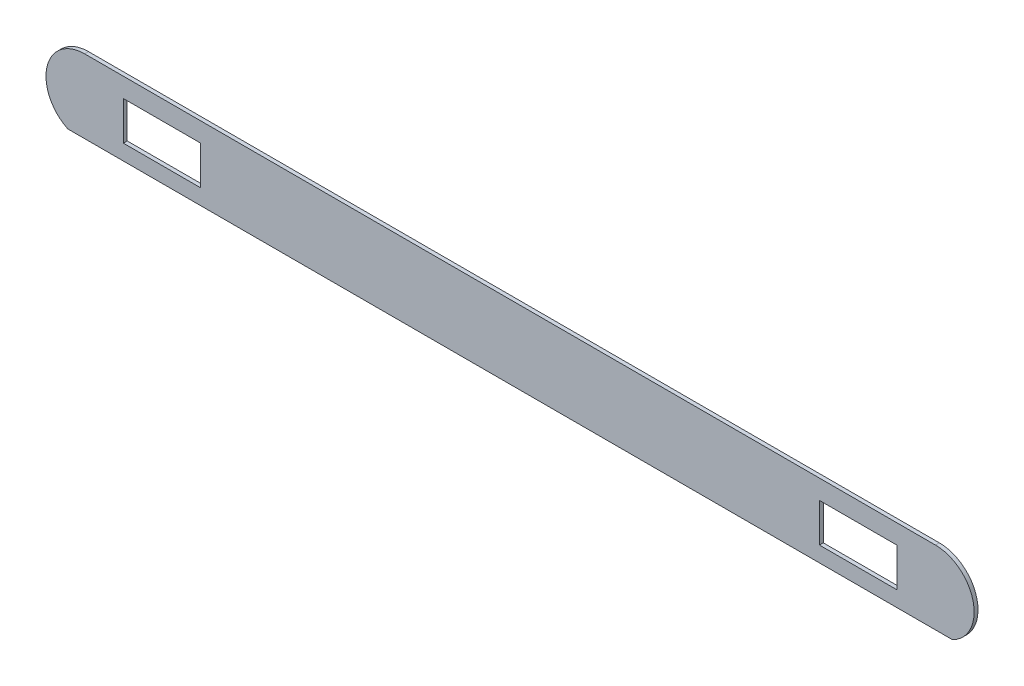
ISO-10303-21;
HEADER;
FILE_DESCRIPTION(('STEP AP214'),'2;1');
FILE_NAME('part.step','',(''),(''),'','','');
FILE_SCHEMA(('AUTOMOTIVE_DESIGN { 1 0 10303 214 1 1 1 1 }'));
ENDSEC;
DATA;
#1=APPLICATION_CONTEXT('core data for automotive mechanical design processes');
#2=APPLICATION_PROTOCOL_DEFINITION('international standard','automotive_design',2000,#1);
#3=PRODUCT_CONTEXT('',#1,'mechanical');
#4=PRODUCT('Part','Part','',(#3));
#5=PRODUCT_RELATED_PRODUCT_CATEGORY('part','',(#4));
#6=PRODUCT_DEFINITION_FORMATION('','',#4);
#7=PRODUCT_DEFINITION_CONTEXT('part definition',#1,'design');
#8=PRODUCT_DEFINITION('design','',#6,#7);
#9=PRODUCT_DEFINITION_SHAPE('','',#8);
#10=(LENGTH_UNIT() NAMED_UNIT(*) SI_UNIT(.MILLI.,.METRE.));
#11=(NAMED_UNIT(*) PLANE_ANGLE_UNIT() SI_UNIT($,.RADIAN.));
#12=(NAMED_UNIT(*) SI_UNIT($,.STERADIAN.) SOLID_ANGLE_UNIT());
#13=UNCERTAINTY_MEASURE_WITH_UNIT(LENGTH_MEASURE(1.E-05),#10,'distance_accuracy_value','');
#14=(GEOMETRIC_REPRESENTATION_CONTEXT(3) GLOBAL_UNCERTAINTY_ASSIGNED_CONTEXT((#13)) GLOBAL_UNIT_ASSIGNED_CONTEXT((#10,
#11,#12)) REPRESENTATION_CONTEXT('',''));
#15=CARTESIAN_POINT('',(0.,0.,0.));
#16=DIRECTION('',(0.,0.,1.));
#17=DIRECTION('',(1.,0.,0.));
#18=AXIS2_PLACEMENT_3D('',#15,#16,#17);
#19=CARTESIAN_POINT('',(0.,-45.,0.));
#20=DIRECTION('',(0.,1.,0.));
#21=DIRECTION('',(0.,0.,1.));
#22=AXIS2_PLACEMENT_3D('',#19,#20,#21);
#23=PLANE('',#22);
#24=DIRECTION('',(0.,0.,-1.));
#25=VECTOR('',#24,1.);
#26=CARTESIAN_POINT('',(619.060752759772,-45.,80.));
#27=LINE('',#26,#25);
#28=CARTESIAN_POINT('',(619.060752759772,-45.,5.));
#29=VERTEX_POINT('',#28);
#30=CARTESIAN_POINT('',(619.060752759772,-45.,0.));
#31=VERTEX_POINT('',#30);
#32=EDGE_CURVE('E217',#29,#31,#27,.T.);
#33=ORIENTED_EDGE('',*,*,#32,.F.);
#34=DIRECTION('',(-1.,0.,0.));
#35=VECTOR('',#34,1.);
#36=CARTESIAN_POINT('',(597.266258042068,-45.,5.));
#37=LINE('',#36,#35);
#38=CARTESIAN_POINT('',(-524.528236675635,-45.,5.));
#39=VERTEX_POINT('',#38);
#40=EDGE_CURVE('E11',#29,#39,#37,.T.);
#41=ORIENTED_EDGE('',*,*,#40,.T.);
#42=DIRECTION('',(0.,0.,-1.));
#43=VECTOR('',#42,1.);
#44=CARTESIAN_POINT('',(-524.528236675635,-45.,80.));
#45=LINE('',#44,#43);
#46=CARTESIAN_POINT('',(-524.528236675635,-45.,0.));
#47=VERTEX_POINT('',#46);
#48=EDGE_CURVE('E55',#47,#39,#45,.F.);
#49=ORIENTED_EDGE('',*,*,#48,.F.);
#50=DIRECTION('',(-1.,0.,0.));
#51=VECTOR('',#50,1.);
#52=CARTESIAN_POINT('',(-502.733741957931,-45.,0.));
#53=LINE('',#52,#51);
#54=EDGE_CURVE('E37',#31,#47,#53,.T.);
#55=ORIENTED_EDGE('',*,*,#54,.F.);
#56=EDGE_LOOP('',(#33,#41,#49,#55));
#57=FACE_BOUND('',#56,.T.);
#58=ADVANCED_FACE('F34',(#57),#23,.F.);
#59=CARTESIAN_POINT('',(-502.733741957931,0.,0.));
#60=DIRECTION('',(0.,0.,1.));
#61=DIRECTION('',(1.,0.,0.));
#62=AXIS2_PLACEMENT_3D('',#59,#60,#61);
#63=PLANE('',#62);
#64=DIRECTION('',(-1.,0.,0.));
#65=VECTOR('',#64,1.);
#66=CARTESIAN_POINT('',(-502.733741957931,25.,0.));
#67=LINE('',#66,#65);
#68=CARTESIAN_POINT('',(-352.733741957931,25.,0.));
#69=VERTEX_POINT('',#68);
#70=CARTESIAN_POINT('',(-452.733741957932,25.,0.));
#71=VERTEX_POINT('',#70);
#72=EDGE_CURVE('E192',#69,#71,#67,.T.);
#73=ORIENTED_EDGE('',*,*,#72,.T.);
#74=DIRECTION('',(0.,-1.,0.));
#75=VECTOR('',#74,1.);
#76=CARTESIAN_POINT('',(-452.733741957932,0.,0.));
#77=LINE('',#76,#75);
#78=CARTESIAN_POINT('',(-452.733741957932,-25.,0.));
#79=VERTEX_POINT('',#78);
#80=EDGE_CURVE('E195',#71,#79,#77,.T.);
#81=ORIENTED_EDGE('',*,*,#80,.T.);
#82=DIRECTION('',(1.,0.,0.));
#83=VECTOR('',#82,1.);
#84=CARTESIAN_POINT('',(-502.733741957931,-25.,0.));
#85=LINE('',#84,#83);
#86=CARTESIAN_POINT('',(-352.733741957931,-25.,0.));
#87=VERTEX_POINT('',#86);
#88=EDGE_CURVE('E189',#79,#87,#85,.T.);
#89=ORIENTED_EDGE('',*,*,#88,.T.);
#90=DIRECTION('',(0.,1.,0.));
#91=VECTOR('',#90,1.);
#92=CARTESIAN_POINT('',(-352.733741957931,0.,0.));
#93=LINE('',#92,#91);
#94=EDGE_CURVE('E130',#87,#69,#93,.T.);
#95=ORIENTED_EDGE('',*,*,#94,.T.);
#96=EDGE_LOOP('',(#73,#81,#89,#95));
#97=FACE_BOUND('',#96,.T.);
#98=DIRECTION('',(-1.,0.,0.));
#99=VECTOR('',#98,1.);
#100=CARTESIAN_POINT('',(-502.733741957931,25.0000000000004,0.));
#101=LINE('',#100,#99);
#102=CARTESIAN_POINT('',(547.266258042068,25.,0.));
#103=VERTEX_POINT('',#102);
#104=CARTESIAN_POINT('',(447.266258042068,25.,0.));
#105=VERTEX_POINT('',#104);
#106=EDGE_CURVE('E183',#103,#105,#101,.T.);
#107=ORIENTED_EDGE('',*,*,#106,.T.);
#108=DIRECTION('',(0.,-1.,0.));
#109=VECTOR('',#108,1.);
#110=CARTESIAN_POINT('',(447.266258042068,0.,0.));
#111=LINE('',#110,#109);
#112=CARTESIAN_POINT('',(447.266258042068,-25.,0.));
#113=VERTEX_POINT('',#112);
#114=EDGE_CURVE('E186',#105,#113,#111,.T.);
#115=ORIENTED_EDGE('',*,*,#114,.T.);
#116=DIRECTION('',(1.,0.,0.));
#117=VECTOR('',#116,1.);
#118=CARTESIAN_POINT('',(-502.733741957931,-25.,0.));
#119=LINE('',#118,#117);
#120=CARTESIAN_POINT('',(547.266258042068,-25.,0.));
#121=VERTEX_POINT('',#120);
#122=EDGE_CURVE('E155',#113,#121,#119,.T.);
#123=ORIENTED_EDGE('',*,*,#122,.T.);
#124=DIRECTION('',(0.,1.,0.));
#125=VECTOR('',#124,1.);
#126=CARTESIAN_POINT('',(547.266258042068,0.,0.));
#127=LINE('',#126,#125);
#128=EDGE_CURVE('E180',#121,#103,#127,.T.);
#129=ORIENTED_EDGE('',*,*,#128,.T.);
#130=EDGE_LOOP('',(#107,#115,#123,#129));
#131=FACE_BOUND('',#130,.T.);
#132=CARTESIAN_POINT('',(597.266258042068,0.,0.));
#133=DIRECTION('',(0.,0.,1.));
#134=DIRECTION('',(1.,0.,0.));
#135=AXIS2_PLACEMENT_3D('',#132,#133,#134);
#136=CIRCLE('',#135,50.);
#137=CARTESIAN_POINT('',(597.266258042068,50.,0.));
#138=VERTEX_POINT('',#137);
#139=EDGE_CURVE('E210',#31,#138,#136,.T.);
#140=ORIENTED_EDGE('',*,*,#139,.F.);
#141=ORIENTED_EDGE('',*,*,#54,.T.);
#142=CARTESIAN_POINT('',(-502.733741957931,0.,0.));
#143=DIRECTION('',(0.,0.,1.));
#144=DIRECTION('',(1.,0.,0.));
#145=AXIS2_PLACEMENT_3D('',#142,#143,#144);
#146=CIRCLE('',#145,50.);
#147=CARTESIAN_POINT('',(-502.733741957931,50.,0.));
#148=VERTEX_POINT('',#147);
#149=EDGE_CURVE('E214',#148,#47,#146,.T.);
#150=ORIENTED_EDGE('',*,*,#149,.F.);
#151=DIRECTION('',(-1.,0.,0.));
#152=VECTOR('',#151,1.);
#153=CARTESIAN_POINT('',(-502.733741957931,50.,0.));
#154=LINE('',#153,#152);
#155=EDGE_CURVE('E204',#138,#148,#154,.T.);
#156=ORIENTED_EDGE('',*,*,#155,.F.);
#157=EDGE_LOOP('',(#140,#141,#150,#156));
#158=FACE_BOUND('',#157,.T.);
#159=ADVANCED_FACE('F222',(#97,#131,#158),#63,.F.);
#160=CARTESIAN_POINT('',(-502.733741957931,0.,80.));
#161=DIRECTION('',(0.,0.,-1.));
#162=DIRECTION('',(-1.,0.,0.));
#163=AXIS2_PLACEMENT_3D('',#160,#161,#162);
#164=CYLINDRICAL_SURFACE('',#163,50.);
#165=ORIENTED_EDGE('',*,*,#149,.T.);
#166=ORIENTED_EDGE('',*,*,#48,.T.);
#167=CARTESIAN_POINT('',(-502.733741957931,0.,5.));
#168=DIRECTION('',(0.,0.,1.));
#169=DIRECTION('',(1.,0.,0.));
#170=AXIS2_PLACEMENT_3D('',#167,#168,#169);
#171=CIRCLE('',#170,50.);
#172=CARTESIAN_POINT('',(-502.733741957931,50.,5.));
#173=VERTEX_POINT('',#172);
#174=EDGE_CURVE('E216',#173,#39,#171,.T.);
#175=ORIENTED_EDGE('',*,*,#174,.F.);
#176=DIRECTION('',(0.,0.,-1.));
#177=VECTOR('',#176,1.);
#178=CARTESIAN_POINT('',(-502.733741957931,50.,80.));
#179=LINE('',#178,#177);
#180=EDGE_CURVE('E201',#173,#148,#179,.T.);
#181=ORIENTED_EDGE('',*,*,#180,.T.);
#182=EDGE_LOOP('',(#165,#166,#175,#181));
#183=FACE_BOUND('',#182,.T.);
#184=ADVANCED_FACE('F225',(#183),#164,.T.);
#185=CARTESIAN_POINT('',(597.266258042068,0.,80.));
#186=DIRECTION('',(0.,0.,-1.));
#187=DIRECTION('',(-1.,0.,0.));
#188=AXIS2_PLACEMENT_3D('',#185,#186,#187);
#189=CYLINDRICAL_SURFACE('',#188,50.);
#190=CARTESIAN_POINT('',(597.266258042068,0.,5.));
#191=DIRECTION('',(0.,0.,1.));
#192=DIRECTION('',(1.,0.,0.));
#193=AXIS2_PLACEMENT_3D('',#190,#191,#192);
#194=CIRCLE('',#193,50.);
#195=CARTESIAN_POINT('',(597.266258042068,50.,5.));
#196=VERTEX_POINT('',#195);
#197=EDGE_CURVE('E212',#29,#196,#194,.T.);
#198=ORIENTED_EDGE('',*,*,#197,.F.);
#199=ORIENTED_EDGE('',*,*,#32,.T.);
#200=ORIENTED_EDGE('',*,*,#139,.T.);
#201=DIRECTION('',(0.,0.,-1.));
#202=VECTOR('',#201,1.);
#203=CARTESIAN_POINT('',(597.266258042068,50.,80.));
#204=LINE('',#203,#202);
#205=EDGE_CURVE('E198',#196,#138,#204,.T.);
#206=ORIENTED_EDGE('',*,*,#205,.F.);
#207=EDGE_LOOP('',(#198,#199,#200,#206));
#208=FACE_BOUND('',#207,.T.);
#209=ADVANCED_FACE('F233',(#208),#189,.T.);
#210=CARTESIAN_POINT('',(597.266258042068,-45.,5.));
#211=DIRECTION('',(0.,0.,1.));
#212=DIRECTION('',(1.,0.,0.));
#213=AXIS2_PLACEMENT_3D('',#210,#211,#212);
#214=PLANE('',#213);
#215=ORIENTED_EDGE('',*,*,#40,.F.);
#216=ORIENTED_EDGE('',*,*,#197,.T.);
#217=DIRECTION('',(1.,0.,0.));
#218=VECTOR('',#217,1.);
#219=CARTESIAN_POINT('',(-502.733741957931,50.,5.));
#220=LINE('',#219,#218);
#221=EDGE_CURVE('E207',#173,#196,#220,.T.);
#222=ORIENTED_EDGE('',*,*,#221,.F.);
#223=ORIENTED_EDGE('',*,*,#174,.T.);
#224=EDGE_LOOP('',(#215,#216,#222,#223));
#225=FACE_BOUND('',#224,.T.);
#226=DIRECTION('',(0.,-1.,0.));
#227=VECTOR('',#226,1.);
#228=CARTESIAN_POINT('',(-452.733741957932,25.,5.));
#229=LINE('',#228,#227);
#230=CARTESIAN_POINT('',(-452.733741957932,25.,5.));
#231=VERTEX_POINT('',#230);
#232=CARTESIAN_POINT('',(-452.733741957931,-25.,5.));
#233=VERTEX_POINT('',#232);
#234=EDGE_CURVE('E143',#231,#233,#229,.T.);
#235=ORIENTED_EDGE('',*,*,#234,.F.);
#236=DIRECTION('',(-1.,0.,0.));
#237=VECTOR('',#236,1.);
#238=CARTESIAN_POINT('',(-452.733741957932,25.,5.));
#239=LINE('',#238,#237);
#240=CARTESIAN_POINT('',(-352.733741957931,25.,5.));
#241=VERTEX_POINT('',#240);
#242=EDGE_CURVE('E148',#241,#231,#239,.T.);
#243=ORIENTED_EDGE('',*,*,#242,.F.);
#244=DIRECTION('',(0.,1.,0.));
#245=VECTOR('',#244,1.);
#246=CARTESIAN_POINT('',(-352.733741957931,25.,5.));
#247=LINE('',#246,#245);
#248=CARTESIAN_POINT('',(-352.733741957931,-25.,5.));
#249=VERTEX_POINT('',#248);
#250=EDGE_CURVE('E127',#249,#241,#247,.T.);
#251=ORIENTED_EDGE('',*,*,#250,.F.);
#252=DIRECTION('',(1.,0.,0.));
#253=VECTOR('',#252,1.);
#254=CARTESIAN_POINT('',(-452.733741957932,-25.,5.));
#255=LINE('',#254,#253);
#256=EDGE_CURVE('E138',#233,#249,#255,.T.);
#257=ORIENTED_EDGE('',*,*,#256,.F.);
#258=EDGE_LOOP('',(#235,#243,#251,#257));
#259=FACE_BOUND('',#258,.T.);
#260=DIRECTION('',(0.,-1.,0.));
#261=VECTOR('',#260,1.);
#262=CARTESIAN_POINT('',(447.266258042068,25.,5.));
#263=LINE('',#262,#261);
#264=CARTESIAN_POINT('',(447.266258042068,25.,5.));
#265=VERTEX_POINT('',#264);
#266=CARTESIAN_POINT('',(447.266258042068,-25.,5.));
#267=VERTEX_POINT('',#266);
#268=EDGE_CURVE('E158',#265,#267,#263,.T.);
#269=ORIENTED_EDGE('',*,*,#268,.F.);
#270=DIRECTION('',(-1.,0.,0.));
#271=VECTOR('',#270,1.);
#272=CARTESIAN_POINT('',(447.266258042068,25.,5.));
#273=LINE('',#272,#271);
#274=CARTESIAN_POINT('',(547.266258042068,25.,5.));
#275=VERTEX_POINT('',#274);
#276=EDGE_CURVE('E166',#275,#265,#273,.T.);
#277=ORIENTED_EDGE('',*,*,#276,.F.);
#278=DIRECTION('',(0.,1.,0.));
#279=VECTOR('',#278,1.);
#280=CARTESIAN_POINT('',(547.266258042068,25.,5.));
#281=LINE('',#280,#279);
#282=CARTESIAN_POINT('',(547.266258042068,-25.,5.));
#283=VERTEX_POINT('',#282);
#284=EDGE_CURVE('E163',#283,#275,#281,.T.);
#285=ORIENTED_EDGE('',*,*,#284,.F.);
#286=DIRECTION('',(1.,0.,0.));
#287=VECTOR('',#286,1.);
#288=CARTESIAN_POINT('',(447.266258042068,-25.,5.));
#289=LINE('',#288,#287);
#290=EDGE_CURVE('E160',#267,#283,#289,.T.);
#291=ORIENTED_EDGE('',*,*,#290,.F.);
#292=EDGE_LOOP('',(#269,#277,#285,#291));
#293=FACE_BOUND('',#292,.T.);
#294=ADVANCED_FACE('F145',(#225,#259,#293),#214,.T.);
#295=CARTESIAN_POINT('',(-502.733741957931,50.,80.));
#296=DIRECTION('',(0.,-1.,0.));
#297=DIRECTION('',(0.,0.,-1.));
#298=AXIS2_PLACEMENT_3D('',#295,#296,#297);
#299=PLANE('',#298);
#300=ORIENTED_EDGE('',*,*,#180,.F.);
#301=ORIENTED_EDGE('',*,*,#221,.T.);
#302=ORIENTED_EDGE('',*,*,#205,.T.);
#303=ORIENTED_EDGE('',*,*,#155,.T.);
#304=EDGE_LOOP('',(#300,#301,#302,#303));
#305=FACE_BOUND('',#304,.T.);
#306=ADVANCED_FACE('F229',(#305),#299,.F.);
#307=CARTESIAN_POINT('',(447.266258042068,25.,-5.));
#308=DIRECTION('',(-1.,0.,0.));
#309=DIRECTION('',(0.,0.,1.));
#310=AXIS2_PLACEMENT_3D('',#307,#308,#309);
#311=PLANE('',#310);
#312=DIRECTION('',(0.,0.,1.));
#313=VECTOR('',#312,1.);
#314=CARTESIAN_POINT('',(447.266258042068,25.,-5.));
#315=LINE('',#314,#313);
#316=EDGE_CURVE('E170',#105,#265,#315,.T.);
#317=ORIENTED_EDGE('',*,*,#316,.T.);
#318=ORIENTED_EDGE('',*,*,#268,.T.);
#319=DIRECTION('',(0.,0.,1.));
#320=VECTOR('',#319,1.);
#321=CARTESIAN_POINT('',(447.266258042068,-25.,-5.));
#322=LINE('',#321,#320);
#323=EDGE_CURVE('E169',#113,#267,#322,.T.);
#324=ORIENTED_EDGE('',*,*,#323,.F.);
#325=ORIENTED_EDGE('',*,*,#114,.F.);
#326=EDGE_LOOP('',(#317,#318,#324,#325));
#327=FACE_BOUND('',#326,.T.);
#328=ADVANCED_FACE('F239',(#327),#311,.F.);
#329=CARTESIAN_POINT('',(447.266258042068,25.,-5.));
#330=DIRECTION('',(0.,1.,0.));
#331=DIRECTION('',(-1.,0.,0.));
#332=AXIS2_PLACEMENT_3D('',#329,#330,#331);
#333=PLANE('',#332);
#334=DIRECTION('',(0.,0.,1.));
#335=VECTOR('',#334,1.);
#336=CARTESIAN_POINT('',(547.266258042068,25.,-5.));
#337=LINE('',#336,#335);
#338=EDGE_CURVE('E172',#103,#275,#337,.T.);
#339=ORIENTED_EDGE('',*,*,#338,.T.);
#340=ORIENTED_EDGE('',*,*,#276,.T.);
#341=ORIENTED_EDGE('',*,*,#316,.F.);
#342=ORIENTED_EDGE('',*,*,#106,.F.);
#343=EDGE_LOOP('',(#339,#340,#341,#342));
#344=FACE_BOUND('',#343,.T.);
#345=ADVANCED_FACE('F264',(#344),#333,.F.);
#346=CARTESIAN_POINT('',(547.266258042068,25.,-5.));
#347=DIRECTION('',(1.,0.,0.));
#348=DIRECTION('',(0.,0.,-1.));
#349=AXIS2_PLACEMENT_3D('',#346,#347,#348);
#350=PLANE('',#349);
#351=DIRECTION('',(0.,0.,1.));
#352=VECTOR('',#351,1.);
#353=CARTESIAN_POINT('',(547.266258042068,-25.,-5.));
#354=LINE('',#353,#352);
#355=EDGE_CURVE('E174',#121,#283,#354,.T.);
#356=ORIENTED_EDGE('',*,*,#355,.T.);
#357=ORIENTED_EDGE('',*,*,#284,.T.);
#358=ORIENTED_EDGE('',*,*,#338,.F.);
#359=ORIENTED_EDGE('',*,*,#128,.F.);
#360=EDGE_LOOP('',(#356,#357,#358,#359));
#361=FACE_BOUND('',#360,.T.);
#362=ADVANCED_FACE('F267',(#361),#350,.F.);
#363=CARTESIAN_POINT('',(447.266258042068,-25.,-5.));
#364=DIRECTION('',(0.,-1.,0.));
#365=DIRECTION('',(0.,0.,-1.));
#366=AXIS2_PLACEMENT_3D('',#363,#364,#365);
#367=PLANE('',#366);
#368=ORIENTED_EDGE('',*,*,#323,.T.);
#369=ORIENTED_EDGE('',*,*,#290,.T.);
#370=ORIENTED_EDGE('',*,*,#355,.F.);
#371=ORIENTED_EDGE('',*,*,#122,.F.);
#372=EDGE_LOOP('',(#368,#369,#370,#371));
#373=FACE_BOUND('',#372,.T.);
#374=ADVANCED_FACE('F262',(#373),#367,.F.);
#375=CARTESIAN_POINT('',(-452.733741957932,25.,-5.));
#376=DIRECTION('',(-1.,0.,0.));
#377=DIRECTION('',(0.,0.,1.));
#378=AXIS2_PLACEMENT_3D('',#375,#376,#377);
#379=PLANE('',#378);
#380=DIRECTION('',(0.,0.,1.));
#381=VECTOR('',#380,1.);
#382=CARTESIAN_POINT('',(-452.733741957932,25.,-5.));
#383=LINE('',#382,#381);
#384=EDGE_CURVE('E153',#71,#231,#383,.T.);
#385=ORIENTED_EDGE('',*,*,#384,.T.);
#386=ORIENTED_EDGE('',*,*,#234,.T.);
#387=DIRECTION('',(0.,0.,1.));
#388=VECTOR('',#387,1.);
#389=CARTESIAN_POINT('',(-452.733741957932,-25.,-5.));
#390=LINE('',#389,#388);
#391=EDGE_CURVE('E134',#79,#233,#390,.T.);
#392=ORIENTED_EDGE('',*,*,#391,.F.);
#393=ORIENTED_EDGE('',*,*,#80,.F.);
#394=EDGE_LOOP('',(#385,#386,#392,#393));
#395=FACE_BOUND('',#394,.T.);
#396=ADVANCED_FACE('F259',(#395),#379,.F.);
#397=CARTESIAN_POINT('',(-452.733741957932,25.,-5.));
#398=DIRECTION('',(0.,1.,0.));
#399=DIRECTION('',(0.,0.,1.));
#400=AXIS2_PLACEMENT_3D('',#397,#398,#399);
#401=PLANE('',#400);
#402=DIRECTION('',(0.,0.,1.));
#403=VECTOR('',#402,1.);
#404=CARTESIAN_POINT('',(-352.733741957931,25.,-5.));
#405=LINE('',#404,#403);
#406=EDGE_CURVE('E133',#69,#241,#405,.T.);
#407=ORIENTED_EDGE('',*,*,#406,.T.);
#408=ORIENTED_EDGE('',*,*,#242,.T.);
#409=ORIENTED_EDGE('',*,*,#384,.F.);
#410=ORIENTED_EDGE('',*,*,#72,.F.);
#411=EDGE_LOOP('',(#407,#408,#409,#410));
#412=FACE_BOUND('',#411,.T.);
#413=ADVANCED_FACE('F255',(#412),#401,.F.);
#414=CARTESIAN_POINT('',(-352.733741957931,25.,-5.));
#415=DIRECTION('',(1.,0.,0.));
#416=DIRECTION('',(0.,0.,-1.));
#417=AXIS2_PLACEMENT_3D('',#414,#415,#416);
#418=PLANE('',#417);
#419=DIRECTION('',(0.,0.,1.));
#420=VECTOR('',#419,1.);
#421=CARTESIAN_POINT('',(-352.733741957931,-25.,-5.));
#422=LINE('',#421,#420);
#423=EDGE_CURVE('E122',#87,#249,#422,.T.);
#424=ORIENTED_EDGE('',*,*,#423,.T.);
#425=ORIENTED_EDGE('',*,*,#250,.T.);
#426=ORIENTED_EDGE('',*,*,#406,.F.);
#427=ORIENTED_EDGE('',*,*,#94,.F.);
#428=EDGE_LOOP('',(#424,#425,#426,#427));
#429=FACE_BOUND('',#428,.T.);
#430=ADVANCED_FACE('F124',(#429),#418,.F.);
#431=CARTESIAN_POINT('',(-452.733741957932,-25.,-5.));
#432=DIRECTION('',(0.,-1.,0.));
#433=DIRECTION('',(0.,0.,-1.));
#434=AXIS2_PLACEMENT_3D('',#431,#432,#433);
#435=PLANE('',#434);
#436=ORIENTED_EDGE('',*,*,#391,.T.);
#437=ORIENTED_EDGE('',*,*,#256,.T.);
#438=ORIENTED_EDGE('',*,*,#423,.F.);
#439=ORIENTED_EDGE('',*,*,#88,.F.);
#440=EDGE_LOOP('',(#436,#437,#438,#439));
#441=FACE_BOUND('',#440,.T.);
#442=ADVANCED_FACE('F139',(#441),#435,.F.);
#443=CLOSED_SHELL('',(#58,#159,#184,#209,#294,#306,#328,#345,#362,#374,#396,#413,#430,#442));
#444=MANIFOLD_SOLID_BREP('B2',#443);
#445=ADVANCED_BREP_SHAPE_REPRESENTATION('',(#18,#444),#14);
#446=SHAPE_DEFINITION_REPRESENTATION(#9,#445);
ENDSEC;
END-ISO-10303-21;
